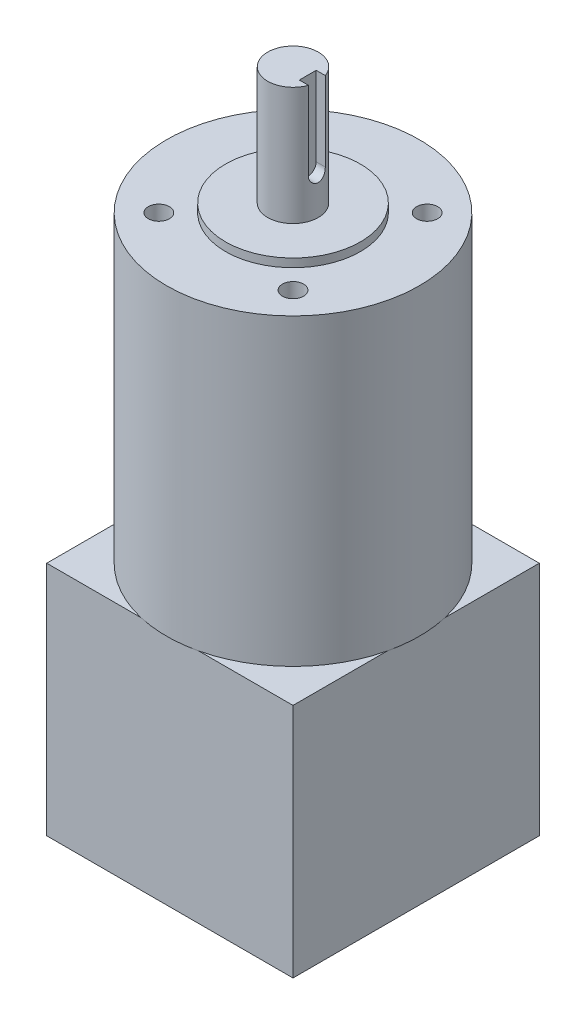
ISO-10303-21;
HEADER;
FILE_DESCRIPTION(('STEP AP214'),'2;1');
FILE_NAME('part.step','',(''),(''),'','','');
FILE_SCHEMA(('AUTOMOTIVE_DESIGN { 1 0 10303 214 1 1 1 1 }'));
ENDSEC;
DATA;
#1=APPLICATION_CONTEXT('core data for automotive mechanical design processes');
#2=APPLICATION_PROTOCOL_DEFINITION('international standard','automotive_design',2000,#1);
#3=PRODUCT_CONTEXT('',#1,'mechanical');
#4=PRODUCT('Part','Part','',(#3));
#5=PRODUCT_RELATED_PRODUCT_CATEGORY('part','',(#4));
#6=PRODUCT_DEFINITION_FORMATION('','',#4);
#7=PRODUCT_DEFINITION_CONTEXT('part definition',#1,'design');
#8=PRODUCT_DEFINITION('design','',#6,#7);
#9=PRODUCT_DEFINITION_SHAPE('','',#8);
#10=(LENGTH_UNIT() NAMED_UNIT(*) SI_UNIT(.MILLI.,.METRE.));
#11=(NAMED_UNIT(*) PLANE_ANGLE_UNIT() SI_UNIT($,.RADIAN.));
#12=(NAMED_UNIT(*) SI_UNIT($,.STERADIAN.) SOLID_ANGLE_UNIT());
#13=UNCERTAINTY_MEASURE_WITH_UNIT(LENGTH_MEASURE(1.E-05),#10,'distance_accuracy_value','');
#14=(GEOMETRIC_REPRESENTATION_CONTEXT(3) GLOBAL_UNCERTAINTY_ASSIGNED_CONTEXT((#13)) GLOBAL_UNIT_ASSIGNED_CONTEXT((#10,
#11,#12)) REPRESENTATION_CONTEXT('',''));
#15=CARTESIAN_POINT('',(0.,0.,0.));
#16=DIRECTION('',(0.,0.,1.));
#17=DIRECTION('',(1.,0.,0.));
#18=AXIS2_PLACEMENT_3D('',#15,#16,#17);
#19=CARTESIAN_POINT('',(0.,158.,0.));
#20=DIRECTION('',(0.,-1.,0.));
#21=DIRECTION('',(0.,0.,-1.));
#22=AXIS2_PLACEMENT_3D('',#19,#20,#21);
#23=CYLINDRICAL_SURFACE('',#22,6.);
#24=CARTESIAN_POINT('',(0.,130.,0.));
#25=DIRECTION('',(0.,1.,0.));
#26=DIRECTION('',(0.,0.,1.));
#27=AXIS2_PLACEMENT_3D('',#24,#25,#26);
#28=CIRCLE('',#27,6.);
#29=CARTESIAN_POINT('',(0.,130.,6.));
#30=VERTEX_POINT('',#29);
#31=EDGE_CURVE('E43',#30,#30,#28,.T.);
#32=ORIENTED_EDGE('',*,*,#31,.T.);
#33=EDGE_LOOP('',(#32));
#34=FACE_BOUND('',#33,.T.);
#35=CARTESIAN_POINT('',(5.65685424949238,139.2,-2.));
#36=CARTESIAN_POINT('',(5.65684884188678,139.145419006398,-2.0000014949184));
#37=CARTESIAN_POINT('',(5.6576451988649,139.090865875621,-1.99776424917479));
#38=CARTESIAN_POINT('',(5.66078654578442,138.98218283189,-1.9888512140728));
#39=CARTESIAN_POINT('',(5.66313111768244,138.928052808681,-1.98217662286705));
#40=CARTESIAN_POINT('',(5.67238184449302,138.76721571361,-1.95562135046157));
#41=CARTESIAN_POINT('',(5.6815058499903,138.661638307459,-1.92920846605622));
#42=CARTESIAN_POINT('',(5.70456149397718,138.456749615112,-1.85991682366085));
#43=CARTESIAN_POINT('',(5.71849047905859,138.357434906254,-1.81704715197507));
#44=CARTESIAN_POINT('',(5.74957574438921,138.167320331989,-1.71614645792973));
#45=CARTESIAN_POINT('',(5.76673400456217,138.076525741865,-1.65810612564546));
#46=CARTESIAN_POINT('',(5.80308960804095,137.902559537351,-1.52610278704601));
#47=CARTESIAN_POINT('',(5.82233755536618,137.819770239075,-1.45164996064407));
#48=CARTESIAN_POINT('',(5.86027697385956,137.667587964417,-1.28997688598296));
#49=CARTESIAN_POINT('',(5.87896834543706,137.598197373488,-1.20275436910906));
#50=CARTESIAN_POINT('',(5.91427765988455,137.473040962392,-1.01520729191251));
#51=CARTESIAN_POINT('',(5.93082875123708,137.417678031195,-0.914600178716988));
#52=CARTESIAN_POINT('',(5.95939217209317,137.324815496625,-0.70485849993172));
#53=CARTESIAN_POINT('',(5.97140588786619,137.287310436359,-0.595726551186839));
#54=CARTESIAN_POINT('',(5.98918142285845,137.232528547817,-0.37605869095607));
#55=CARTESIAN_POINT('',(5.99514617977147,137.214593454893,-0.265703668920222));
#56=CARTESIAN_POINT('',(6.00087216807634,137.197367402949,-0.043397938911344));
#57=CARTESIAN_POINT('',(6.00063487762605,137.198072001461,0.0685523824907874));
#58=CARTESIAN_POINT('',(5.99412077270532,137.217688566213,0.286207690558787));
#59=CARTESIAN_POINT('',(5.98808121982527,137.235885275919,0.391985405251076));
#60=CARTESIAN_POINT('',(5.97093921001647,137.288786397348,0.598888128753317));
#61=CARTESIAN_POINT('',(5.95983647235462,137.323491724412,0.700012879232935));
#62=CARTESIAN_POINT('',(5.93351336542608,137.408842739201,0.896305246061934));
#63=CARTESIAN_POINT('',(5.91824075676625,137.459692090245,0.991377011307993));
#64=CARTESIAN_POINT('',(5.88516775360088,137.575719902781,1.17184917819498));
#65=CARTESIAN_POINT('',(5.86736667195186,137.640902262093,1.25724693942937));
#66=CARTESIAN_POINT('',(5.83012543885479,137.787342099994,1.42019467942242));
#67=CARTESIAN_POINT('',(5.81064757359828,137.869211087219,1.4971872232254));
#68=CARTESIAN_POINT('',(5.77294980945703,138.044882979432,1.63654404964076));
#69=CARTESIAN_POINT('',(5.75473031831507,138.138689724806,1.69890360636762));
#70=CARTESIAN_POINT('',(5.72140062752635,138.337360356707,1.80800665118557));
#71=CARTESIAN_POINT('',(5.70634029896469,138.442367029866,1.85450601901537));
#72=CARTESIAN_POINT('',(5.68162194124078,138.65929395518,1.92892046140224));
#73=CARTESIAN_POINT('',(5.67195538817986,138.771202986744,1.95686487211072));
#74=CARTESIAN_POINT('',(5.6627308418944,138.936837273496,1.98331631256166));
#75=CARTESIAN_POINT('',(5.66053335389204,138.989282779708,1.98957012251023));
#76=CARTESIAN_POINT('',(5.65759407142798,139.0944761568,1.99790923214239));
#77=CARTESIAN_POINT('',(5.65685039859056,139.147223549089,1.99999991078996));
#78=CARTESIAN_POINT('',(5.65685424949238,139.2,2.));
#79=B_SPLINE_CURVE_WITH_KNOTS('',3,(#35,#36,#37,#38,#39,#40,#41,#42,#43,#44,#45,#46,#47,#48,#49,
#50,#51,#52,#53,#54,#55,#56,#57,#58,#59,#60,#61,#62,#63,#64,#65,#66,#67,#68,#69,#70,#71,#72,#73,
#74,#75,#76,#77,#78),.UNSPECIFIED.,.F.,.F.,(4,2,2,2,2,2,2,2,2,2,2,2,2,2,2,2,2,2,2,2,2,4),(0.,
0.163636969470881,0.327229772338919,0.653162396790756,0.978915321932496,1.30486862627063,
1.64233009925357,1.97985159727496,2.32618265866202,2.67240782242254,3.00658941454805,
3.34069136061284,3.6616883693147,3.98270317816495,4.30794037651935,4.63326613177537,
4.97388108116099,5.31460588498484,5.66036059856082,6.0055673497368,6.16399790665498,
6.32222363058112),.UNSPECIFIED.);
#80=CARTESIAN_POINT('',(5.65685424949238,139.2,-2.));
#81=VERTEX_POINT('',#80);
#82=CARTESIAN_POINT('',(5.65685424949238,139.2,2.));
#83=VERTEX_POINT('',#82);
#84=EDGE_CURVE('E136',#81,#83,#79,.T.);
#85=ORIENTED_EDGE('',*,*,#84,.T.);
#86=DIRECTION('',(0.,-1.,0.));
#87=VECTOR('',#86,1.);
#88=CARTESIAN_POINT('',(5.65685424949238,158.,2.));
#89=LINE('',#88,#87);
#90=CARTESIAN_POINT('',(5.65685424949238,158.,2.));
#91=VERTEX_POINT('',#90);
#92=EDGE_CURVE('E153',#83,#91,#89,.F.);
#93=ORIENTED_EDGE('',*,*,#92,.T.);
#94=CARTESIAN_POINT('',(0.,158.,0.));
#95=DIRECTION('',(0.,1.,0.));
#96=DIRECTION('',(0.,0.,1.));
#97=AXIS2_PLACEMENT_3D('',#94,#95,#96);
#98=CIRCLE('',#97,6.);
#99=CARTESIAN_POINT('',(5.65685424949238,158.,-2.));
#100=VERTEX_POINT('',#99);
#101=EDGE_CURVE('E196',#100,#91,#98,.T.);
#102=ORIENTED_EDGE('',*,*,#101,.F.);
#103=DIRECTION('',(0.,-1.,0.));
#104=VECTOR('',#103,1.);
#105=CARTESIAN_POINT('',(5.65685424949238,158.,-2.));
#106=LINE('',#105,#104);
#107=EDGE_CURVE('E158',#100,#81,#106,.T.);
#108=ORIENTED_EDGE('',*,*,#107,.T.);
#109=EDGE_LOOP('',(#85,#93,#102,#108));
#110=FACE_BOUND('',#109,.T.);
#111=ADVANCED_FACE('F39',(#34,#110),#23,.T.);
#112=CARTESIAN_POINT('',(0.,56.,0.));
#113=DIRECTION('',(0.,-1.,0.));
#114=DIRECTION('',(0.,0.,-1.));
#115=AXIS2_PLACEMENT_3D('',#112,#113,#114);
#116=PLANE('',#115);
#117=CARTESIAN_POINT('',(0.,56.,0.));
#118=DIRECTION('',(0.,1.,0.));
#119=DIRECTION('',(0.,0.,1.));
#120=AXIS2_PLACEMENT_3D('',#117,#118,#119);
#121=CIRCLE('',#120,30.);
#122=CARTESIAN_POINT('',(6.83929089891636,56.,29.21));
#123=VERTEX_POINT('',#122);
#124=CARTESIAN_POINT('',(29.21,56.,6.83929089891638));
#125=VERTEX_POINT('',#124);
#126=EDGE_CURVE('E64',#123,#125,#121,.T.);
#127=ORIENTED_EDGE('',*,*,#126,.F.);
#128=DIRECTION('',(1.,0.,0.));
#129=VECTOR('',#128,1.);
#130=CARTESIAN_POINT('',(-29.21,56.,29.21));
#131=LINE('',#130,#129);
#132=CARTESIAN_POINT('',(29.21,56.,29.21));
#133=VERTEX_POINT('',#132);
#134=EDGE_CURVE('E229',#123,#133,#131,.T.);
#135=ORIENTED_EDGE('',*,*,#134,.T.);
#136=DIRECTION('',(0.,0.,-1.));
#137=VECTOR('',#136,1.);
#138=CARTESIAN_POINT('',(29.21,56.,29.21));
#139=LINE('',#138,#137);
#140=EDGE_CURVE('E213',#133,#125,#139,.T.);
#141=ORIENTED_EDGE('',*,*,#140,.T.);
#142=EDGE_LOOP('',(#127,#135,#141));
#143=FACE_BOUND('',#142,.T.);
#144=ADVANCED_FACE('F297',(#143),#116,.F.);
#145=CARTESIAN_POINT('',(29.21,56.,-6.83929089891638));
#146=VERTEX_POINT('',#145);
#147=CARTESIAN_POINT('',(6.83929089891638,56.,-29.21));
#148=VERTEX_POINT('',#147);
#149=EDGE_CURVE('E49',#146,#148,#121,.T.);
#150=ORIENTED_EDGE('',*,*,#149,.F.);
#151=CARTESIAN_POINT('',(29.21,56.,-29.21));
#152=VERTEX_POINT('',#151);
#153=EDGE_CURVE('E218',#146,#152,#139,.T.);
#154=ORIENTED_EDGE('',*,*,#153,.T.);
#155=DIRECTION('',(-1.,0.,0.));
#156=VECTOR('',#155,1.);
#157=CARTESIAN_POINT('',(-29.21,56.,-29.21));
#158=LINE('',#157,#156);
#159=EDGE_CURVE('E219',#152,#148,#158,.T.);
#160=ORIENTED_EDGE('',*,*,#159,.T.);
#161=EDGE_LOOP('',(#150,#154,#160));
#162=FACE_BOUND('',#161,.T.);
#163=ADVANCED_FACE('F309',(#162),#116,.F.);
#164=CARTESIAN_POINT('',(-6.83929089891638,56.,-29.21));
#165=VERTEX_POINT('',#164);
#166=CARTESIAN_POINT('',(-29.21,56.,-6.83929089891635));
#167=VERTEX_POINT('',#166);
#168=EDGE_CURVE('E267',#165,#167,#121,.T.);
#169=ORIENTED_EDGE('',*,*,#168,.F.);
#170=CARTESIAN_POINT('',(-29.21,56.,-29.21));
#171=VERTEX_POINT('',#170);
#172=EDGE_CURVE('E216',#165,#171,#158,.T.);
#173=ORIENTED_EDGE('',*,*,#172,.T.);
#174=DIRECTION('',(0.,0.,1.));
#175=VECTOR('',#174,1.);
#176=CARTESIAN_POINT('',(-29.21,56.,29.21));
#177=LINE('',#176,#175);
#178=EDGE_CURVE('E225',#171,#167,#177,.T.);
#179=ORIENTED_EDGE('',*,*,#178,.T.);
#180=EDGE_LOOP('',(#169,#173,#179));
#181=FACE_BOUND('',#180,.T.);
#182=ADVANCED_FACE('F324',(#181),#116,.F.);
#183=CARTESIAN_POINT('',(29.21,56.,29.21));
#184=DIRECTION('',(-1.,0.,0.));
#185=DIRECTION('',(0.,0.,1.));
#186=AXIS2_PLACEMENT_3D('',#183,#184,#185);
#187=PLANE('',#186);
#188=DIRECTION('',(0.,0.,-1.));
#189=VECTOR('',#188,1.);
#190=CARTESIAN_POINT('',(29.21,0.,29.21));
#191=LINE('',#190,#189);
#192=CARTESIAN_POINT('',(29.21,0.,29.21));
#193=VERTEX_POINT('',#192);
#194=CARTESIAN_POINT('',(29.21,0.,-29.21));
#195=VERTEX_POINT('',#194);
#196=EDGE_CURVE('E208',#193,#195,#191,.T.);
#197=ORIENTED_EDGE('',*,*,#196,.T.);
#198=DIRECTION('',(0.,-1.,0.));
#199=VECTOR('',#198,1.);
#200=CARTESIAN_POINT('',(29.21,56.,-29.21));
#201=LINE('',#200,#199);
#202=EDGE_CURVE('E259',#152,#195,#201,.T.);
#203=ORIENTED_EDGE('',*,*,#202,.F.);
#204=ORIENTED_EDGE('',*,*,#153,.F.);
#205=EDGE_CURVE('E217',#125,#146,#139,.T.);
#206=ORIENTED_EDGE('',*,*,#205,.F.);
#207=ORIENTED_EDGE('',*,*,#140,.F.);
#208=DIRECTION('',(0.,-1.,0.));
#209=VECTOR('',#208,1.);
#210=CARTESIAN_POINT('',(29.21,56.,29.21));
#211=LINE('',#210,#209);
#212=EDGE_CURVE('E234',#133,#193,#211,.T.);
#213=ORIENTED_EDGE('',*,*,#212,.T.);
#214=EDGE_LOOP('',(#197,#203,#204,#206,#207,#213));
#215=FACE_BOUND('',#214,.T.);
#216=ADVANCED_FACE('F41',(#215),#187,.F.);
#217=CARTESIAN_POINT('',(-29.21,56.,-29.21));
#218=DIRECTION('',(0.,0.,1.));
#219=DIRECTION('',(1.,0.,0.));
#220=AXIS2_PLACEMENT_3D('',#217,#218,#219);
#221=PLANE('',#220);
#222=DIRECTION('',(-1.,0.,0.));
#223=VECTOR('',#222,1.);
#224=CARTESIAN_POINT('',(-29.21,0.,-29.21));
#225=LINE('',#224,#223);
#226=CARTESIAN_POINT('',(-29.21,0.,-29.21));
#227=VERTEX_POINT('',#226);
#228=EDGE_CURVE('E239',#195,#227,#225,.T.);
#229=ORIENTED_EDGE('',*,*,#228,.T.);
#230=DIRECTION('',(0.,-1.,0.));
#231=VECTOR('',#230,1.);
#232=CARTESIAN_POINT('',(-29.21,56.,-29.21));
#233=LINE('',#232,#231);
#234=EDGE_CURVE('E255',#171,#227,#233,.T.);
#235=ORIENTED_EDGE('',*,*,#234,.F.);
#236=ORIENTED_EDGE('',*,*,#172,.F.);
#237=EDGE_CURVE('E224',#148,#165,#158,.T.);
#238=ORIENTED_EDGE('',*,*,#237,.F.);
#239=ORIENTED_EDGE('',*,*,#159,.F.);
#240=ORIENTED_EDGE('',*,*,#202,.T.);
#241=EDGE_LOOP('',(#229,#235,#236,#238,#239,#240));
#242=FACE_BOUND('',#241,.T.);
#243=ADVANCED_FACE('F310',(#242),#221,.F.);
#244=CARTESIAN_POINT('',(-29.21,56.,29.21));
#245=DIRECTION('',(1.,0.,0.));
#246=DIRECTION('',(0.,0.,-1.));
#247=AXIS2_PLACEMENT_3D('',#244,#245,#246);
#248=PLANE('',#247);
#249=DIRECTION('',(0.,0.,1.));
#250=VECTOR('',#249,1.);
#251=CARTESIAN_POINT('',(-29.21,0.,29.21));
#252=LINE('',#251,#250);
#253=CARTESIAN_POINT('',(-29.21,0.,29.21));
#254=VERTEX_POINT('',#253);
#255=EDGE_CURVE('E242',#227,#254,#252,.T.);
#256=ORIENTED_EDGE('',*,*,#255,.T.);
#257=DIRECTION('',(0.,-1.,0.));
#258=VECTOR('',#257,1.);
#259=CARTESIAN_POINT('',(-29.21,56.,29.21));
#260=LINE('',#259,#258);
#261=CARTESIAN_POINT('',(-29.21,56.,29.21));
#262=VERTEX_POINT('',#261);
#263=EDGE_CURVE('E251',#262,#254,#260,.T.);
#264=ORIENTED_EDGE('',*,*,#263,.F.);
#265=CARTESIAN_POINT('',(-29.21,56.,6.83929089891635));
#266=VERTEX_POINT('',#265);
#267=EDGE_CURVE('E223',#266,#262,#177,.T.);
#268=ORIENTED_EDGE('',*,*,#267,.F.);
#269=EDGE_CURVE('E230',#167,#266,#177,.T.);
#270=ORIENTED_EDGE('',*,*,#269,.F.);
#271=ORIENTED_EDGE('',*,*,#178,.F.);
#272=ORIENTED_EDGE('',*,*,#234,.T.);
#273=EDGE_LOOP('',(#256,#264,#268,#270,#271,#272));
#274=FACE_BOUND('',#273,.T.);
#275=ADVANCED_FACE('F319',(#274),#248,.F.);
#276=CARTESIAN_POINT('',(-29.21,56.,29.21));
#277=DIRECTION('',(0.,0.,-1.));
#278=DIRECTION('',(-1.,0.,0.));
#279=AXIS2_PLACEMENT_3D('',#276,#277,#278);
#280=PLANE('',#279);
#281=DIRECTION('',(1.,0.,0.));
#282=VECTOR('',#281,1.);
#283=CARTESIAN_POINT('',(-29.21,0.,29.21));
#284=LINE('',#283,#282);
#285=EDGE_CURVE('E245',#254,#193,#284,.T.);
#286=ORIENTED_EDGE('',*,*,#285,.T.);
#287=ORIENTED_EDGE('',*,*,#212,.F.);
#288=ORIENTED_EDGE('',*,*,#134,.F.);
#289=CARTESIAN_POINT('',(-6.83929089891636,56.,29.21));
#290=VERTEX_POINT('',#289);
#291=EDGE_CURVE('E235',#290,#123,#131,.T.);
#292=ORIENTED_EDGE('',*,*,#291,.F.);
#293=EDGE_CURVE('E231',#262,#290,#131,.T.);
#294=ORIENTED_EDGE('',*,*,#293,.F.);
#295=ORIENTED_EDGE('',*,*,#263,.T.);
#296=EDGE_LOOP('',(#286,#287,#288,#292,#294,#295));
#297=FACE_BOUND('',#296,.T.);
#298=ADVANCED_FACE('F299',(#297),#280,.F.);
#299=EDGE_CURVE('E212',#266,#290,#121,.T.);
#300=ORIENTED_EDGE('',*,*,#299,.F.);
#301=ORIENTED_EDGE('',*,*,#267,.T.);
#302=ORIENTED_EDGE('',*,*,#293,.T.);
#303=EDGE_LOOP('',(#300,#301,#302));
#304=FACE_BOUND('',#303,.T.);
#305=ADVANCED_FACE('F330',(#304),#116,.F.);
#306=CARTESIAN_POINT('',(0.,0.,0.));
#307=DIRECTION('',(0.,-1.,0.));
#308=DIRECTION('',(0.,0.,-1.));
#309=AXIS2_PLACEMENT_3D('',#306,#307,#308);
#310=PLANE('',#309);
#311=ORIENTED_EDGE('',*,*,#196,.F.);
#312=ORIENTED_EDGE('',*,*,#285,.F.);
#313=ORIENTED_EDGE('',*,*,#255,.F.);
#314=ORIENTED_EDGE('',*,*,#228,.F.);
#315=EDGE_LOOP('',(#311,#312,#313,#314));
#316=FACE_BOUND('',#315,.T.);
#317=ADVANCED_FACE('F314',(#316),#310,.T.);
#318=CARTESIAN_POINT('',(0.,56.,0.));
#319=DIRECTION('',(0.,1.,0.));
#320=DIRECTION('',(0.,0.,1.));
#321=AXIS2_PLACEMENT_3D('',#318,#319,#320);
#322=PLANE('',#321);
#323=EDGE_CURVE('E211',#125,#146,#121,.T.);
#324=ORIENTED_EDGE('',*,*,#323,.F.);
#325=ORIENTED_EDGE('',*,*,#205,.T.);
#326=EDGE_LOOP('',(#324,#325));
#327=FACE_BOUND('',#326,.T.);
#328=ADVANCED_FACE('F337',(#327),#322,.F.);
#329=EDGE_CURVE('E278',#148,#165,#121,.T.);
#330=ORIENTED_EDGE('',*,*,#329,.F.);
#331=ORIENTED_EDGE('',*,*,#237,.T.);
#332=EDGE_LOOP('',(#330,#331));
#333=FACE_BOUND('',#332,.T.);
#334=ADVANCED_FACE('F360',(#333),#322,.F.);
#335=EDGE_CURVE('E281',#167,#266,#121,.T.);
#336=ORIENTED_EDGE('',*,*,#335,.F.);
#337=ORIENTED_EDGE('',*,*,#269,.T.);
#338=EDGE_LOOP('',(#336,#337));
#339=FACE_BOUND('',#338,.T.);
#340=ADVANCED_FACE('F326',(#339),#322,.F.);
#341=EDGE_CURVE('E203',#290,#123,#121,.T.);
#342=ORIENTED_EDGE('',*,*,#341,.F.);
#343=ORIENTED_EDGE('',*,*,#291,.T.);
#344=EDGE_LOOP('',(#342,#343));
#345=FACE_BOUND('',#344,.T.);
#346=ADVANCED_FACE('F290',(#345),#322,.F.);
#347=CARTESIAN_POINT('',(0.,128.,0.));
#348=DIRECTION('',(0.,-1.,0.));
#349=DIRECTION('',(0.,0.,-1.));
#350=AXIS2_PLACEMENT_3D('',#347,#348,#349);
#351=CYLINDRICAL_SURFACE('',#350,30.);
#352=CARTESIAN_POINT('',(0.,128.,0.));
#353=DIRECTION('',(0.,1.,0.));
#354=DIRECTION('',(0.,0.,1.));
#355=AXIS2_PLACEMENT_3D('',#352,#353,#354);
#356=CIRCLE('',#355,30.);
#357=CARTESIAN_POINT('',(0.,128.,30.));
#358=VERTEX_POINT('',#357);
#359=EDGE_CURVE('E204',#358,#358,#356,.T.);
#360=ORIENTED_EDGE('',*,*,#359,.F.);
#361=EDGE_LOOP('',(#360));
#362=FACE_BOUND('',#361,.T.);
#363=ORIENTED_EDGE('',*,*,#126,.T.);
#364=ORIENTED_EDGE('',*,*,#323,.T.);
#365=ORIENTED_EDGE('',*,*,#149,.T.);
#366=ORIENTED_EDGE('',*,*,#329,.T.);
#367=ORIENTED_EDGE('',*,*,#168,.T.);
#368=ORIENTED_EDGE('',*,*,#335,.T.);
#369=ORIENTED_EDGE('',*,*,#299,.T.);
#370=ORIENTED_EDGE('',*,*,#341,.T.);
#371=EDGE_LOOP('',(#363,#364,#365,#366,#367,#368,#369,#370));
#372=FACE_BOUND('',#371,.T.);
#373=ADVANCED_FACE('F287',(#362,#372),#351,.T.);
#374=CARTESIAN_POINT('',(0.,128.,0.));
#375=DIRECTION('',(0.,1.,0.));
#376=DIRECTION('',(0.,0.,1.));
#377=AXIS2_PLACEMENT_3D('',#374,#375,#376);
#378=PLANE('',#377);
#379=CARTESIAN_POINT('',(0.,128.,0.));
#380=DIRECTION('',(0.,1.,0.));
#381=DIRECTION('',(0.,0.,1.));
#382=AXIS2_PLACEMENT_3D('',#379,#380,#381);
#383=CIRCLE('',#382,16.);
#384=CARTESIAN_POINT('',(0.,128.,16.));
#385=VERTEX_POINT('',#384);
#386=EDGE_CURVE('E148',#385,#385,#383,.T.);
#387=ORIENTED_EDGE('',*,*,#386,.F.);
#388=EDGE_LOOP('',(#387));
#389=FACE_BOUND('',#388,.T.);
#390=CARTESIAN_POINT('',(-15.9099025766973,128.,15.9099025766973));
#391=DIRECTION('',(0.,1.,0.));
#392=DIRECTION('',(0.,0.,-1.));
#393=AXIS2_PLACEMENT_3D('',#390,#391,#392);
#394=CIRCLE('',#393,2.49999999999999);
#395=CARTESIAN_POINT('',(-15.9099025766973,128.,13.4099025766973));
#396=VERTEX_POINT('',#395);
#397=EDGE_CURVE('E167',#396,#396,#394,.T.);
#398=ORIENTED_EDGE('',*,*,#397,.F.);
#399=EDGE_LOOP('',(#398));
#400=FACE_BOUND('',#399,.T.);
#401=CARTESIAN_POINT('',(15.9099025766973,128.,15.9099025766973));
#402=DIRECTION('',(0.,1.,0.));
#403=DIRECTION('',(0.,0.,1.));
#404=AXIS2_PLACEMENT_3D('',#401,#402,#403);
#405=CIRCLE('',#404,2.49999999999999);
#406=CARTESIAN_POINT('',(15.9099025766973,128.,18.4099025766973));
#407=VERTEX_POINT('',#406);
#408=EDGE_CURVE('E181',#407,#407,#405,.T.);
#409=ORIENTED_EDGE('',*,*,#408,.F.);
#410=EDGE_LOOP('',(#409));
#411=FACE_BOUND('',#410,.T.);
#412=CARTESIAN_POINT('',(15.9099025766973,128.,-15.9099025766973));
#413=DIRECTION('',(0.,1.,0.));
#414=DIRECTION('',(0.,0.,-1.));
#415=AXIS2_PLACEMENT_3D('',#412,#413,#414);
#416=CIRCLE('',#415,2.49999999999999);
#417=CARTESIAN_POINT('',(15.9099025766973,128.,-18.4099025766973));
#418=VERTEX_POINT('',#417);
#419=EDGE_CURVE('E173',#418,#418,#416,.T.);
#420=ORIENTED_EDGE('',*,*,#419,.F.);
#421=EDGE_LOOP('',(#420));
#422=FACE_BOUND('',#421,.T.);
#423=CARTESIAN_POINT('',(-15.9099025766973,128.,-15.9099025766973));
#424=DIRECTION('',(0.,1.,0.));
#425=DIRECTION('',(0.,0.,1.));
#426=AXIS2_PLACEMENT_3D('',#423,#424,#425);
#427=CIRCLE('',#426,2.49999999999999);
#428=CARTESIAN_POINT('',(-15.9099025766973,128.,-13.4099025766973));
#429=VERTEX_POINT('',#428);
#430=EDGE_CURVE('E172',#429,#429,#427,.T.);
#431=ORIENTED_EDGE('',*,*,#430,.F.);
#432=EDGE_LOOP('',(#431));
#433=FACE_BOUND('',#432,.T.);
#434=ORIENTED_EDGE('',*,*,#359,.T.);
#435=EDGE_LOOP('',(#434));
#436=FACE_BOUND('',#435,.T.);
#437=ADVANCED_FACE('F354',(#389,#400,#411,#422,#433,#436),#378,.T.);
#438=CARTESIAN_POINT('',(-15.9099025766973,102.6,-15.9099025766973));
#439=DIRECTION('',(0.,1.,0.));
#440=DIRECTION('',(0.,0.,1.));
#441=AXIS2_PLACEMENT_3D('',#438,#439,#440);
#442=CYLINDRICAL_SURFACE('',#441,2.49999999999999);
#443=CARTESIAN_POINT('',(-15.9099025766973,102.6,-15.9099025766973));
#444=DIRECTION('',(0.,1.,0.));
#445=DIRECTION('',(0.,0.,1.));
#446=AXIS2_PLACEMENT_3D('',#443,#444,#445);
#447=CIRCLE('',#446,2.49999999999999);
#448=CARTESIAN_POINT('',(-15.9099025766973,102.6,-13.4099025766973));
#449=VERTEX_POINT('',#448);
#450=EDGE_CURVE('E192',#449,#449,#447,.T.);
#451=ORIENTED_EDGE('',*,*,#450,.F.);
#452=EDGE_LOOP('',(#451));
#453=FACE_BOUND('',#452,.T.);
#454=ORIENTED_EDGE('',*,*,#430,.T.);
#455=EDGE_LOOP('',(#454));
#456=FACE_BOUND('',#455,.T.);
#457=ADVANCED_FACE('F357',(#453,#456),#442,.F.);
#458=CARTESIAN_POINT('',(-15.9099025766973,102.6,-15.9099025766973));
#459=DIRECTION('',(0.,1.,0.));
#460=DIRECTION('',(0.,0.,1.));
#461=AXIS2_PLACEMENT_3D('',#458,#459,#460);
#462=PLANE('',#461);
#463=ORIENTED_EDGE('',*,*,#450,.T.);
#464=EDGE_LOOP('',(#463));
#465=FACE_BOUND('',#464,.T.);
#466=ADVANCED_FACE('F478',(#465),#462,.T.);
#467=CARTESIAN_POINT('',(15.9099025766973,102.6,-15.9099025766973));
#468=DIRECTION('',(0.,1.,0.));
#469=DIRECTION('',(0.,0.,1.));
#470=AXIS2_PLACEMENT_3D('',#467,#468,#469);
#471=CYLINDRICAL_SURFACE('',#470,2.49999999999999);
#472=CARTESIAN_POINT('',(15.9099025766973,102.6,-15.9099025766973));
#473=DIRECTION('',(0.,1.,0.));
#474=DIRECTION('',(0.,0.,-1.));
#475=AXIS2_PLACEMENT_3D('',#472,#473,#474);
#476=CIRCLE('',#475,2.49999999999999);
#477=CARTESIAN_POINT('',(15.9099025766973,102.6,-18.4099025766973));
#478=VERTEX_POINT('',#477);
#479=EDGE_CURVE('E168',#478,#478,#476,.T.);
#480=ORIENTED_EDGE('',*,*,#479,.F.);
#481=EDGE_LOOP('',(#480));
#482=FACE_BOUND('',#481,.T.);
#483=ORIENTED_EDGE('',*,*,#419,.T.);
#484=EDGE_LOOP('',(#483));
#485=FACE_BOUND('',#484,.T.);
#486=ADVANCED_FACE('F486',(#482,#485),#471,.F.);
#487=CARTESIAN_POINT('',(15.9099025766973,102.6,-15.9099025766973));
#488=DIRECTION('',(0.,-1.,0.));
#489=DIRECTION('',(0.,0.,-1.));
#490=AXIS2_PLACEMENT_3D('',#487,#488,#489);
#491=PLANE('',#490);
#492=ORIENTED_EDGE('',*,*,#479,.T.);
#493=EDGE_LOOP('',(#492));
#494=FACE_BOUND('',#493,.T.);
#495=ADVANCED_FACE('F495',(#494),#491,.F.);
#496=CARTESIAN_POINT('',(15.9099025766973,102.6,15.9099025766973));
#497=DIRECTION('',(0.,1.,0.));
#498=DIRECTION('',(0.,0.,1.));
#499=AXIS2_PLACEMENT_3D('',#496,#497,#498);
#500=CYLINDRICAL_SURFACE('',#499,2.49999999999999);
#501=CARTESIAN_POINT('',(15.9099025766973,102.6,15.9099025766973));
#502=DIRECTION('',(0.,1.,0.));
#503=DIRECTION('',(0.,0.,1.));
#504=AXIS2_PLACEMENT_3D('',#501,#502,#503);
#505=CIRCLE('',#504,2.49999999999999);
#506=CARTESIAN_POINT('',(15.9099025766973,102.6,18.4099025766973));
#507=VERTEX_POINT('',#506);
#508=EDGE_CURVE('E177',#507,#507,#505,.T.);
#509=ORIENTED_EDGE('',*,*,#508,.F.);
#510=EDGE_LOOP('',(#509));
#511=FACE_BOUND('',#510,.T.);
#512=ORIENTED_EDGE('',*,*,#408,.T.);
#513=EDGE_LOOP('',(#512));
#514=FACE_BOUND('',#513,.T.);
#515=ADVANCED_FACE('F504',(#511,#514),#500,.F.);
#516=CARTESIAN_POINT('',(15.9099025766973,102.6,15.9099025766973));
#517=DIRECTION('',(0.,1.,0.));
#518=DIRECTION('',(0.,0.,1.));
#519=AXIS2_PLACEMENT_3D('',#516,#517,#518);
#520=PLANE('',#519);
#521=ORIENTED_EDGE('',*,*,#508,.T.);
#522=EDGE_LOOP('',(#521));
#523=FACE_BOUND('',#522,.T.);
#524=ADVANCED_FACE('F513',(#523),#520,.T.);
#525=CARTESIAN_POINT('',(-15.9099025766973,102.6,15.9099025766973));
#526=DIRECTION('',(0.,1.,0.));
#527=DIRECTION('',(0.,0.,1.));
#528=AXIS2_PLACEMENT_3D('',#525,#526,#527);
#529=CYLINDRICAL_SURFACE('',#528,2.49999999999999);
#530=CARTESIAN_POINT('',(-15.9099025766973,102.6,15.9099025766973));
#531=DIRECTION('',(0.,1.,0.));
#532=DIRECTION('',(0.,0.,-1.));
#533=AXIS2_PLACEMENT_3D('',#530,#531,#532);
#534=CIRCLE('',#533,2.49999999999999);
#535=CARTESIAN_POINT('',(-15.9099025766973,102.6,13.4099025766973));
#536=VERTEX_POINT('',#535);
#537=EDGE_CURVE('E185',#536,#536,#534,.T.);
#538=ORIENTED_EDGE('',*,*,#537,.F.);
#539=EDGE_LOOP('',(#538));
#540=FACE_BOUND('',#539,.T.);
#541=ORIENTED_EDGE('',*,*,#397,.T.);
#542=EDGE_LOOP('',(#541));
#543=FACE_BOUND('',#542,.T.);
#544=ADVANCED_FACE('F522',(#540,#543),#529,.F.);
#545=CARTESIAN_POINT('',(-15.9099025766973,102.6,15.9099025766973));
#546=DIRECTION('',(0.,-1.,0.));
#547=DIRECTION('',(0.,0.,-1.));
#548=AXIS2_PLACEMENT_3D('',#545,#546,#547);
#549=PLANE('',#548);
#550=ORIENTED_EDGE('',*,*,#537,.T.);
#551=EDGE_LOOP('',(#550));
#552=FACE_BOUND('',#551,.T.);
#553=ADVANCED_FACE('F531',(#552),#549,.F.);
#554=CARTESIAN_POINT('',(0.,130.,0.));
#555=DIRECTION('',(0.,-1.,0.));
#556=DIRECTION('',(0.,0.,-1.));
#557=AXIS2_PLACEMENT_3D('',#554,#555,#556);
#558=CYLINDRICAL_SURFACE('',#557,16.);
#559=CARTESIAN_POINT('',(0.,130.,0.));
#560=DIRECTION('',(0.,1.,0.));
#561=DIRECTION('',(0.,0.,1.));
#562=AXIS2_PLACEMENT_3D('',#559,#560,#561);
#563=CIRCLE('',#562,16.);
#564=CARTESIAN_POINT('',(0.,130.,16.));
#565=VERTEX_POINT('',#564);
#566=EDGE_CURVE('E611',#565,#565,#563,.T.);
#567=ORIENTED_EDGE('',*,*,#566,.F.);
#568=EDGE_LOOP('',(#567));
#569=FACE_BOUND('',#568,.T.);
#570=ORIENTED_EDGE('',*,*,#386,.T.);
#571=EDGE_LOOP('',(#570));
#572=FACE_BOUND('',#571,.T.);
#573=ADVANCED_FACE('F539',(#569,#572),#558,.T.);
#574=CARTESIAN_POINT('',(0.,130.,0.));
#575=DIRECTION('',(0.,1.,0.));
#576=DIRECTION('',(0.,0.,1.));
#577=AXIS2_PLACEMENT_3D('',#574,#575,#576);
#578=PLANE('',#577);
#579=ORIENTED_EDGE('',*,*,#31,.F.);
#580=EDGE_LOOP('',(#579));
#581=FACE_BOUND('',#580,.T.);
#582=ORIENTED_EDGE('',*,*,#566,.T.);
#583=EDGE_LOOP('',(#582));
#584=FACE_BOUND('',#583,.T.);
#585=ADVANCED_FACE('F566',(#581,#584),#578,.T.);
#586=CARTESIAN_POINT('',(3.5,139.2,-2.));
#587=DIRECTION('',(-1.,0.,0.));
#588=DIRECTION('',(0.,0.,1.));
#589=AXIS2_PLACEMENT_3D('',#586,#587,#588);
#590=PLANE('',#589);
#591=DIRECTION('',(0.,0.,1.));
#592=VECTOR('',#591,1.);
#593=CARTESIAN_POINT('',(3.5,158.,-2.));
#594=LINE('',#593,#592);
#595=CARTESIAN_POINT('',(3.5,158.,-2.));
#596=VERTEX_POINT('',#595);
#597=CARTESIAN_POINT('',(3.5,158.,2.));
#598=VERTEX_POINT('',#597);
#599=EDGE_CURVE('E56',#596,#598,#594,.T.);
#600=ORIENTED_EDGE('',*,*,#599,.T.);
#601=DIRECTION('',(0.,1.,0.));
#602=VECTOR('',#601,1.);
#603=CARTESIAN_POINT('',(3.5,139.2,2.));
#604=LINE('',#603,#602);
#605=CARTESIAN_POINT('',(3.5,139.2,2.));
#606=VERTEX_POINT('',#605);
#607=EDGE_CURVE('E141',#606,#598,#604,.T.);
#608=ORIENTED_EDGE('',*,*,#607,.F.);
#609=CARTESIAN_POINT('',(3.5,139.2,0.));
#610=DIRECTION('',(1.,0.,0.));
#611=DIRECTION('',(0.,0.,-1.));
#612=AXIS2_PLACEMENT_3D('',#609,#610,#611);
#613=CIRCLE('',#612,2.);
#614=CARTESIAN_POINT('',(3.5,139.2,-2.));
#615=VERTEX_POINT('',#614);
#616=EDGE_CURVE('E134',#606,#615,#613,.T.);
#617=ORIENTED_EDGE('',*,*,#616,.T.);
#618=DIRECTION('',(0.,1.,0.));
#619=VECTOR('',#618,1.);
#620=CARTESIAN_POINT('',(3.5,139.2,-2.));
#621=LINE('',#620,#619);
#622=EDGE_CURVE('E145',#615,#596,#621,.T.);
#623=ORIENTED_EDGE('',*,*,#622,.T.);
#624=EDGE_LOOP('',(#600,#608,#617,#623));
#625=FACE_BOUND('',#624,.T.);
#626=ADVANCED_FACE('F144',(#625),#590,.F.);
#627=CARTESIAN_POINT('',(6.,139.2,2.));
#628=DIRECTION('',(0.,0.,1.));
#629=DIRECTION('',(1.,0.,0.));
#630=AXIS2_PLACEMENT_3D('',#627,#628,#629);
#631=PLANE('',#630);
#632=DIRECTION('',(1.,0.,0.));
#633=VECTOR('',#632,1.);
#634=CARTESIAN_POINT('',(6.,139.2,2.));
#635=LINE('',#634,#633);
#636=EDGE_CURVE('E142',#606,#83,#635,.T.);
#637=ORIENTED_EDGE('',*,*,#636,.F.);
#638=ORIENTED_EDGE('',*,*,#607,.T.);
#639=DIRECTION('',(1.,0.,0.));
#640=VECTOR('',#639,1.);
#641=CARTESIAN_POINT('',(6.,158.,2.));
#642=LINE('',#641,#640);
#643=EDGE_CURVE('E162',#598,#91,#642,.T.);
#644=ORIENTED_EDGE('',*,*,#643,.T.);
#645=ORIENTED_EDGE('',*,*,#92,.F.);
#646=EDGE_LOOP('',(#637,#638,#644,#645));
#647=FACE_BOUND('',#646,.T.);
#648=ADVANCED_FACE('F548',(#647),#631,.F.);
#649=CARTESIAN_POINT('',(6.,139.2,-2.));
#650=DIRECTION('',(0.,0.,-1.));
#651=DIRECTION('',(-1.,0.,0.));
#652=AXIS2_PLACEMENT_3D('',#649,#650,#651);
#653=PLANE('',#652);
#654=DIRECTION('',(-1.,0.,0.));
#655=VECTOR('',#654,1.);
#656=CARTESIAN_POINT('',(0.,158.,-2.));
#657=LINE('',#656,#655);
#658=EDGE_CURVE('E11',#100,#596,#657,.T.);
#659=ORIENTED_EDGE('',*,*,#658,.T.);
#660=ORIENTED_EDGE('',*,*,#622,.F.);
#661=DIRECTION('',(-1.,0.,0.));
#662=VECTOR('',#661,1.);
#663=CARTESIAN_POINT('',(6.,139.2,-2.));
#664=LINE('',#663,#662);
#665=EDGE_CURVE('E131',#81,#615,#664,.T.);
#666=ORIENTED_EDGE('',*,*,#665,.F.);
#667=ORIENTED_EDGE('',*,*,#107,.F.);
#668=EDGE_LOOP('',(#659,#660,#666,#667));
#669=FACE_BOUND('',#668,.T.);
#670=ADVANCED_FACE('F150',(#669),#653,.F.);
#671=CARTESIAN_POINT('',(0.,158.,0.));
#672=DIRECTION('',(0.,1.,0.));
#673=DIRECTION('',(0.,0.,1.));
#674=AXIS2_PLACEMENT_3D('',#671,#672,#673);
#675=PLANE('',#674);
#676=ORIENTED_EDGE('',*,*,#658,.F.);
#677=ORIENTED_EDGE('',*,*,#101,.T.);
#678=ORIENTED_EDGE('',*,*,#643,.F.);
#679=ORIENTED_EDGE('',*,*,#599,.F.);
#680=EDGE_LOOP('',(#676,#677,#678,#679));
#681=FACE_BOUND('',#680,.T.);
#682=ADVANCED_FACE('F352',(#681),#675,.T.);
#683=CARTESIAN_POINT('',(30.001,139.2,0.));
#684=DIRECTION('',(-1.,0.,0.));
#685=DIRECTION('',(0.,0.,1.));
#686=AXIS2_PLACEMENT_3D('',#683,#684,#685);
#687=CYLINDRICAL_SURFACE('',#686,2.);
#688=ORIENTED_EDGE('',*,*,#665,.T.);
#689=ORIENTED_EDGE('',*,*,#616,.F.);
#690=ORIENTED_EDGE('',*,*,#636,.T.);
#691=ORIENTED_EDGE('',*,*,#84,.F.);
#692=EDGE_LOOP('',(#688,#689,#690,#691));
#693=FACE_BOUND('',#692,.T.);
#694=ADVANCED_FACE('F133',(#693),#687,.F.);
#695=CLOSED_SHELL('',(#111,#144,#163,#182,#216,#243,#275,#298,#305,#317,#328,#334,#340,#346,
#373,#437,#457,#466,#486,#495,#515,#524,#544,#553,#573,#585,#626,#648,#670,#682,#694));
#696=MANIFOLD_SOLID_BREP('B2',#695);
#697=ADVANCED_BREP_SHAPE_REPRESENTATION('',(#18,#696),#14);
#698=SHAPE_DEFINITION_REPRESENTATION(#9,#697);
ENDSEC;
END-ISO-10303-21;
